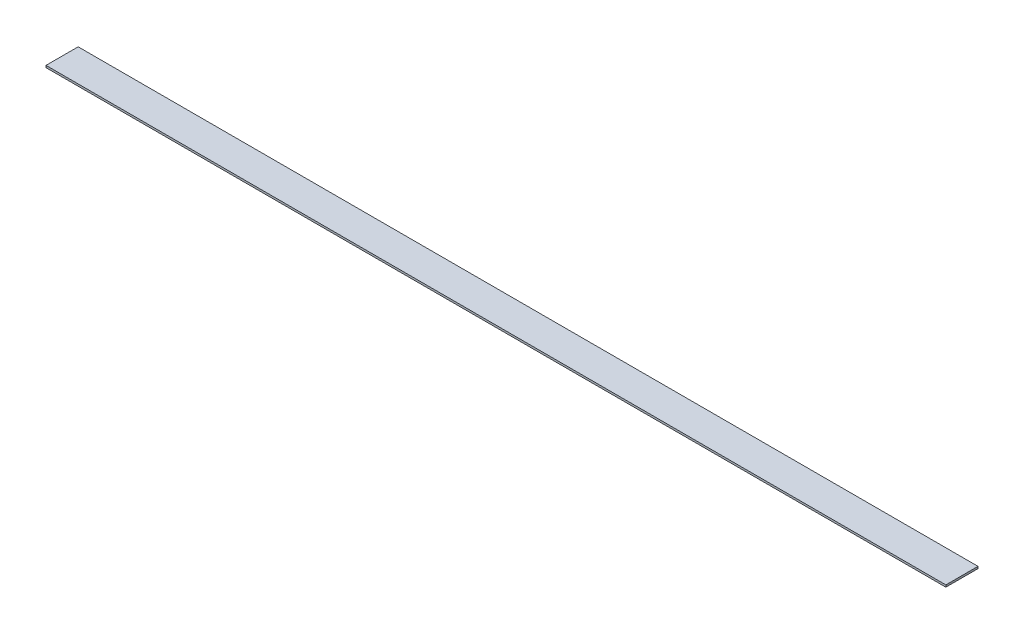
ISO-10303-21;
HEADER;
FILE_DESCRIPTION(('STEP AP214'),'2;1');
FILE_NAME('part.step','',(''),(''),'','','');
FILE_SCHEMA(('AUTOMOTIVE_DESIGN { 1 0 10303 214 1 1 1 1 }'));
ENDSEC;
DATA;
#1=APPLICATION_CONTEXT('core data for automotive mechanical design processes');
#2=APPLICATION_PROTOCOL_DEFINITION('international standard','automotive_design',2000,#1);
#3=PRODUCT_CONTEXT('',#1,'mechanical');
#4=PRODUCT('Part','Part','',(#3));
#5=PRODUCT_RELATED_PRODUCT_CATEGORY('part','',(#4));
#6=PRODUCT_DEFINITION_FORMATION('','',#4);
#7=PRODUCT_DEFINITION_CONTEXT('part definition',#1,'design');
#8=PRODUCT_DEFINITION('design','',#6,#7);
#9=PRODUCT_DEFINITION_SHAPE('','',#8);
#10=(LENGTH_UNIT() NAMED_UNIT(*) SI_UNIT(.MILLI.,.METRE.));
#11=(NAMED_UNIT(*) PLANE_ANGLE_UNIT() SI_UNIT($,.RADIAN.));
#12=(NAMED_UNIT(*) SI_UNIT($,.STERADIAN.) SOLID_ANGLE_UNIT());
#13=UNCERTAINTY_MEASURE_WITH_UNIT(LENGTH_MEASURE(1.E-05),#10,'distance_accuracy_value','');
#14=(GEOMETRIC_REPRESENTATION_CONTEXT(3) GLOBAL_UNCERTAINTY_ASSIGNED_CONTEXT((#13)) GLOBAL_UNIT_ASSIGNED_CONTEXT((#10,
#11,#12)) REPRESENTATION_CONTEXT('',''));
#15=CARTESIAN_POINT('',(0.,0.,0.));
#16=DIRECTION('',(0.,0.,1.));
#17=DIRECTION('',(1.,0.,0.));
#18=AXIS2_PLACEMENT_3D('',#15,#16,#17);
#19=CARTESIAN_POINT('',(0.,1.5875,0.));
#20=DIRECTION('',(1.,0.,0.));
#21=DIRECTION('',(0.,0.,-1.));
#22=AXIS2_PLACEMENT_3D('',#19,#20,#21);
#23=PLANE('',#22);
#24=DIRECTION('',(0.,0.,1.));
#25=VECTOR('',#24,1.);
#26=CARTESIAN_POINT('',(0.,0.,0.));
#27=LINE('',#26,#25);
#28=CARTESIAN_POINT('',(0.,0.,-25.4));
#29=VERTEX_POINT('',#28);
#30=CARTESIAN_POINT('',(0.,0.,0.));
#31=VERTEX_POINT('',#30);
#32=EDGE_CURVE('E98',#29,#31,#27,.T.);
#33=ORIENTED_EDGE('',*,*,#32,.T.);
#34=DIRECTION('',(0.,-1.,0.));
#35=VECTOR('',#34,1.);
#36=CARTESIAN_POINT('',(0.,1.5875,0.));
#37=LINE('',#36,#35);
#38=CARTESIAN_POINT('',(0.,1.5875,0.));
#39=VERTEX_POINT('',#38);
#40=EDGE_CURVE('E11',#39,#31,#37,.T.);
#41=ORIENTED_EDGE('',*,*,#40,.F.);
#42=DIRECTION('',(0.,0.,1.));
#43=VECTOR('',#42,1.);
#44=CARTESIAN_POINT('',(0.,1.5875,0.));
#45=LINE('',#44,#43);
#46=CARTESIAN_POINT('',(0.,1.5875,-25.4));
#47=VERTEX_POINT('',#46);
#48=EDGE_CURVE('E86',#47,#39,#45,.T.);
#49=ORIENTED_EDGE('',*,*,#48,.F.);
#50=DIRECTION('',(0.,-1.,0.));
#51=VECTOR('',#50,1.);
#52=CARTESIAN_POINT('',(0.,1.5875,-25.4));
#53=LINE('',#52,#51);
#54=EDGE_CURVE('E94',#47,#29,#53,.T.);
#55=ORIENTED_EDGE('',*,*,#54,.T.);
#56=EDGE_LOOP('',(#33,#41,#49,#55));
#57=FACE_BOUND('',#56,.T.);
#58=ADVANCED_FACE('F35',(#57),#23,.F.);
#59=CARTESIAN_POINT('',(0.,1.5875,0.));
#60=DIRECTION('',(0.,0.,-1.));
#61=DIRECTION('',(-1.,0.,0.));
#62=AXIS2_PLACEMENT_3D('',#59,#60,#61);
#63=PLANE('',#62);
#64=DIRECTION('',(1.,0.,0.));
#65=VECTOR('',#64,1.);
#66=CARTESIAN_POINT('',(0.,0.,0.));
#67=LINE('',#66,#65);
#68=CARTESIAN_POINT('',(711.2,0.,0.));
#69=VERTEX_POINT('',#68);
#70=EDGE_CURVE('E90',#31,#69,#67,.T.);
#71=ORIENTED_EDGE('',*,*,#70,.T.);
#72=DIRECTION('',(0.,-1.,0.));
#73=VECTOR('',#72,1.);
#74=CARTESIAN_POINT('',(711.2,1.5875,0.));
#75=LINE('',#74,#73);
#76=CARTESIAN_POINT('',(711.2,1.5875,0.));
#77=VERTEX_POINT('',#76);
#78=EDGE_CURVE('E43',#77,#69,#75,.T.);
#79=ORIENTED_EDGE('',*,*,#78,.F.);
#80=DIRECTION('',(1.,0.,0.));
#81=VECTOR('',#80,1.);
#82=CARTESIAN_POINT('',(0.,1.5875,0.));
#83=LINE('',#82,#81);
#84=EDGE_CURVE('E81',#39,#77,#83,.T.);
#85=ORIENTED_EDGE('',*,*,#84,.F.);
#86=ORIENTED_EDGE('',*,*,#40,.T.);
#87=EDGE_LOOP('',(#71,#79,#85,#86));
#88=FACE_BOUND('',#87,.T.);
#89=ADVANCED_FACE('F89',(#88),#63,.F.);
#90=CARTESIAN_POINT('',(711.2,1.5875,0.));
#91=DIRECTION('',(-1.,0.,0.));
#92=DIRECTION('',(0.,0.,1.));
#93=AXIS2_PLACEMENT_3D('',#90,#91,#92);
#94=PLANE('',#93);
#95=DIRECTION('',(0.,0.,-1.));
#96=VECTOR('',#95,1.);
#97=CARTESIAN_POINT('',(711.2,0.,0.));
#98=LINE('',#97,#96);
#99=CARTESIAN_POINT('',(711.2,0.,-25.4));
#100=VERTEX_POINT('',#99);
#101=EDGE_CURVE('E68',#69,#100,#98,.T.);
#102=ORIENTED_EDGE('',*,*,#101,.T.);
#103=DIRECTION('',(0.,-1.,0.));
#104=VECTOR('',#103,1.);
#105=CARTESIAN_POINT('',(711.2,1.5875,-25.4));
#106=LINE('',#105,#104);
#107=CARTESIAN_POINT('',(711.2,1.5875,-25.4));
#108=VERTEX_POINT('',#107);
#109=EDGE_CURVE('E91',#108,#100,#106,.T.);
#110=ORIENTED_EDGE('',*,*,#109,.F.);
#111=DIRECTION('',(0.,0.,-1.));
#112=VECTOR('',#111,1.);
#113=CARTESIAN_POINT('',(711.2,1.5875,0.));
#114=LINE('',#113,#112);
#115=EDGE_CURVE('E84',#77,#108,#114,.T.);
#116=ORIENTED_EDGE('',*,*,#115,.F.);
#117=ORIENTED_EDGE('',*,*,#78,.T.);
#118=EDGE_LOOP('',(#102,#110,#116,#117));
#119=FACE_BOUND('',#118,.T.);
#120=ADVANCED_FACE('F92',(#119),#94,.F.);
#121=CARTESIAN_POINT('',(0.,1.5875,-25.4));
#122=DIRECTION('',(0.,0.,1.));
#123=DIRECTION('',(1.,0.,0.));
#124=AXIS2_PLACEMENT_3D('',#121,#122,#123);
#125=PLANE('',#124);
#126=DIRECTION('',(-1.,0.,0.));
#127=VECTOR('',#126,1.);
#128=CARTESIAN_POINT('',(0.,0.,-25.4));
#129=LINE('',#128,#127);
#130=EDGE_CURVE('E74',#100,#29,#129,.T.);
#131=ORIENTED_EDGE('',*,*,#130,.T.);
#132=ORIENTED_EDGE('',*,*,#54,.F.);
#133=DIRECTION('',(-1.,0.,0.));
#134=VECTOR('',#133,1.);
#135=CARTESIAN_POINT('',(0.,1.5875,-25.4));
#136=LINE('',#135,#134);
#137=EDGE_CURVE('E51',#108,#47,#136,.T.);
#138=ORIENTED_EDGE('',*,*,#137,.F.);
#139=ORIENTED_EDGE('',*,*,#109,.T.);
#140=EDGE_LOOP('',(#131,#132,#138,#139));
#141=FACE_BOUND('',#140,.T.);
#142=ADVANCED_FACE('F105',(#141),#125,.F.);
#143=CARTESIAN_POINT('',(0.,1.5875,0.));
#144=DIRECTION('',(0.,-1.,0.));
#145=DIRECTION('',(0.,0.,-1.));
#146=AXIS2_PLACEMENT_3D('',#143,#144,#145);
#147=PLANE('',#146);
#148=ORIENTED_EDGE('',*,*,#48,.T.);
#149=ORIENTED_EDGE('',*,*,#84,.T.);
#150=ORIENTED_EDGE('',*,*,#115,.T.);
#151=ORIENTED_EDGE('',*,*,#137,.T.);
#152=EDGE_LOOP('',(#148,#149,#150,#151));
#153=FACE_BOUND('',#152,.T.);
#154=ADVANCED_FACE('F82',(#153),#147,.F.);
#155=CARTESIAN_POINT('',(0.,0.,0.));
#156=DIRECTION('',(0.,-1.,0.));
#157=DIRECTION('',(0.,0.,-1.));
#158=AXIS2_PLACEMENT_3D('',#155,#156,#157);
#159=PLANE('',#158);
#160=ORIENTED_EDGE('',*,*,#32,.F.);
#161=ORIENTED_EDGE('',*,*,#130,.F.);
#162=ORIENTED_EDGE('',*,*,#101,.F.);
#163=ORIENTED_EDGE('',*,*,#70,.F.);
#164=EDGE_LOOP('',(#160,#161,#162,#163));
#165=FACE_BOUND('',#164,.T.);
#166=ADVANCED_FACE('F108',(#165),#159,.T.);
#167=CLOSED_SHELL('',(#58,#89,#120,#142,#154,#166));
#168=MANIFOLD_SOLID_BREP('B2',#167);
#169=ADVANCED_BREP_SHAPE_REPRESENTATION('',(#18,#168),#14);
#170=SHAPE_DEFINITION_REPRESENTATION(#9,#169);
ENDSEC;
END-ISO-10303-21;
